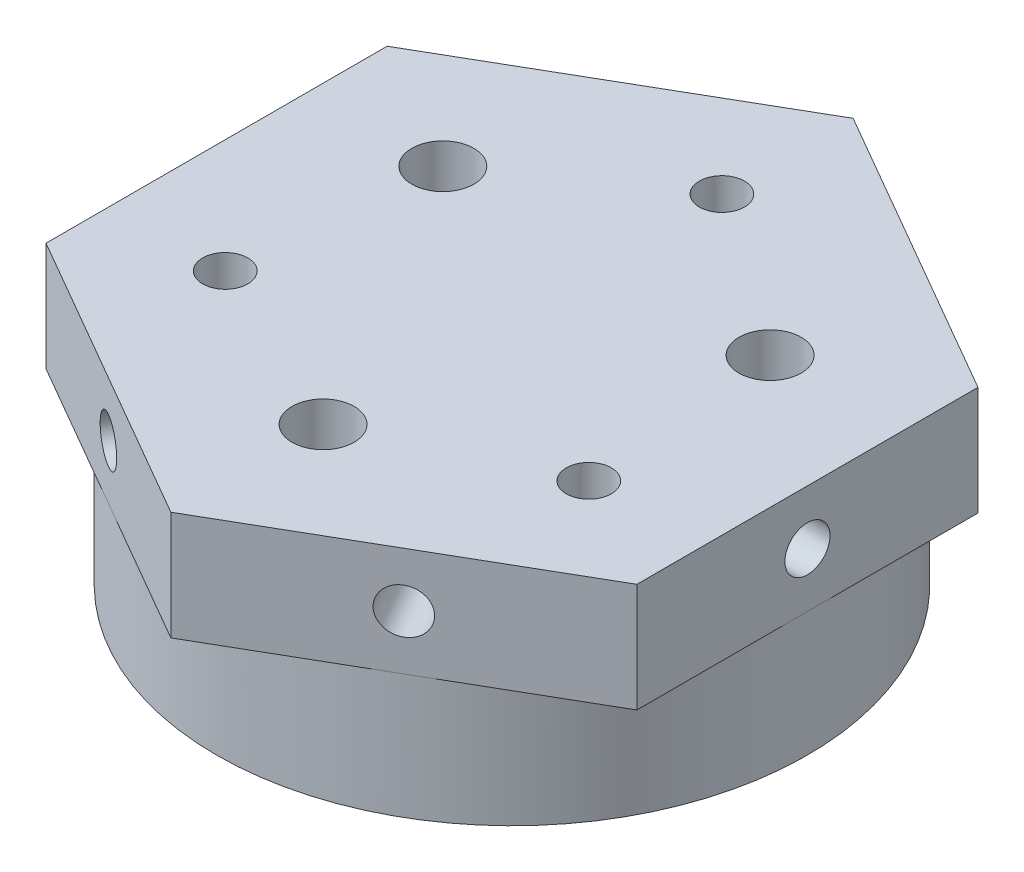
ISO-10303-21;
HEADER;
FILE_DESCRIPTION(('STEP AP214'),'2;1');
FILE_NAME('part.step','',(''),(''),'','','');
FILE_SCHEMA(('AUTOMOTIVE_DESIGN { 1 0 10303 214 1 1 1 1 }'));
ENDSEC;
DATA;
#1=APPLICATION_CONTEXT('core data for automotive mechanical design processes');
#2=APPLICATION_PROTOCOL_DEFINITION('international standard','automotive_design',2000,#1);
#3=PRODUCT_CONTEXT('',#1,'mechanical');
#4=PRODUCT('Part','Part','',(#3));
#5=PRODUCT_RELATED_PRODUCT_CATEGORY('part','',(#4));
#6=PRODUCT_DEFINITION_FORMATION('','',#4);
#7=PRODUCT_DEFINITION_CONTEXT('part definition',#1,'design');
#8=PRODUCT_DEFINITION('design','',#6,#7);
#9=PRODUCT_DEFINITION_SHAPE('','',#8);
#10=(LENGTH_UNIT() NAMED_UNIT(*) SI_UNIT(.MILLI.,.METRE.));
#11=(NAMED_UNIT(*) PLANE_ANGLE_UNIT() SI_UNIT($,.RADIAN.));
#12=(NAMED_UNIT(*) SI_UNIT($,.STERADIAN.) SOLID_ANGLE_UNIT());
#13=UNCERTAINTY_MEASURE_WITH_UNIT(LENGTH_MEASURE(1.E-05),#10,'distance_accuracy_value','');
#14=(GEOMETRIC_REPRESENTATION_CONTEXT(3) GLOBAL_UNCERTAINTY_ASSIGNED_CONTEXT((#13)) GLOBAL_UNIT_ASSIGNED_CONTEXT((#10,
#11,#12)) REPRESENTATION_CONTEXT('',''));
#15=CARTESIAN_POINT('',(0.,0.,0.));
#16=DIRECTION('',(0.,0.,1.));
#17=DIRECTION('',(1.,0.,0.));
#18=AXIS2_PLACEMENT_3D('',#15,#16,#17);
#19=CARTESIAN_POINT('',(0.,15.,0.));
#20=DIRECTION('',(0.,-1.,0.));
#21=DIRECTION('',(0.,0.,-1.));
#22=AXIS2_PLACEMENT_3D('',#19,#20,#21);
#23=CYLINDRICAL_SURFACE('',#22,19.);
#24=CARTESIAN_POINT('',(0.,0.,0.));
#25=DIRECTION('',(0.,1.,0.));
#26=DIRECTION('',(0.,0.,1.));
#27=AXIS2_PLACEMENT_3D('',#24,#25,#26);
#28=CIRCLE('',#27,19.);
#29=CARTESIAN_POINT('',(0.,0.,19.));
#30=VERTEX_POINT('',#29);
#31=EDGE_CURVE('E11',#30,#30,#28,.T.);
#32=ORIENTED_EDGE('',*,*,#31,.T.);
#33=EDGE_LOOP('',(#32));
#34=FACE_BOUND('',#33,.T.);
#35=CARTESIAN_POINT('',(0.,8.,0.));
#36=DIRECTION('',(0.,1.,0.));
#37=DIRECTION('',(0.,0.,1.));
#38=AXIS2_PLACEMENT_3D('',#35,#36,#37);
#39=CIRCLE('',#38,19.);
#40=CARTESIAN_POINT('',(9.50000000000001,8.,16.4544826719043));
#41=VERTEX_POINT('',#40);
#42=CARTESIAN_POINT('',(19.,8.,0.));
#43=VERTEX_POINT('',#42);
#44=EDGE_CURVE('E203',#41,#43,#39,.T.);
#45=ORIENTED_EDGE('',*,*,#44,.F.);
#46=CARTESIAN_POINT('',(-9.50000000000001,8.,16.4544826719043));
#47=VERTEX_POINT('',#46);
#48=EDGE_CURVE('E184',#47,#41,#39,.T.);
#49=ORIENTED_EDGE('',*,*,#48,.F.);
#50=CARTESIAN_POINT('',(-19.,8.,0.));
#51=VERTEX_POINT('',#50);
#52=EDGE_CURVE('E202',#51,#47,#39,.T.);
#53=ORIENTED_EDGE('',*,*,#52,.F.);
#54=CARTESIAN_POINT('',(-9.5,8.,-16.4544826719043));
#55=VERTEX_POINT('',#54);
#56=EDGE_CURVE('E302',#55,#51,#39,.T.);
#57=ORIENTED_EDGE('',*,*,#56,.F.);
#58=CARTESIAN_POINT('',(9.5,8.,-16.4544826719043));
#59=VERTEX_POINT('',#58);
#60=EDGE_CURVE('E61',#59,#55,#39,.T.);
#61=ORIENTED_EDGE('',*,*,#60,.F.);
#62=EDGE_CURVE('E56',#43,#59,#39,.T.);
#63=ORIENTED_EDGE('',*,*,#62,.F.);
#64=EDGE_LOOP('',(#45,#49,#53,#57,#61,#63));
#65=FACE_BOUND('',#64,.T.);
#66=ADVANCED_FACE('F41',(#34,#65),#23,.T.);
#67=CARTESIAN_POINT('',(0.,15.,0.));
#68=DIRECTION('',(0.,1.,0.));
#69=DIRECTION('',(0.,0.,1.));
#70=AXIS2_PLACEMENT_3D('',#67,#68,#69);
#71=PLANE('',#70);
#72=CARTESIAN_POINT('',(0.,15.,12.15));
#73=DIRECTION('',(0.,1.,0.));
#74=DIRECTION('',(0.,0.,1.));
#75=AXIS2_PLACEMENT_3D('',#72,#73,#74);
#76=CIRCLE('',#75,2.);
#77=CARTESIAN_POINT('',(0.,15.,14.15));
#78=VERTEX_POINT('',#77);
#79=EDGE_CURVE('E213',#78,#78,#76,.T.);
#80=ORIENTED_EDGE('',*,*,#79,.F.);
#81=EDGE_LOOP('',(#80));
#82=FACE_BOUND('',#81,.T.);
#83=CARTESIAN_POINT('',(11.6913429510899,15.,6.75000000000006));
#84=DIRECTION('',(0.,1.,0.));
#85=DIRECTION('',(0.,0.,1.));
#86=AXIS2_PLACEMENT_3D('',#83,#84,#85);
#87=CIRCLE('',#86,1.45);
#88=CARTESIAN_POINT('',(11.6913429510899,15.,8.20000000000005));
#89=VERTEX_POINT('',#88);
#90=EDGE_CURVE('E229',#89,#89,#87,.T.);
#91=ORIENTED_EDGE('',*,*,#90,.F.);
#92=EDGE_LOOP('',(#91));
#93=FACE_BOUND('',#92,.T.);
#94=CARTESIAN_POINT('',(0.,15.,-13.5));
#95=DIRECTION('',(0.,1.,0.));
#96=DIRECTION('',(0.,0.,1.));
#97=AXIS2_PLACEMENT_3D('',#94,#95,#96);
#98=CIRCLE('',#97,1.45);
#99=CARTESIAN_POINT('',(0.,15.,-12.05));
#100=VERTEX_POINT('',#99);
#101=EDGE_CURVE('E49',#100,#100,#98,.T.);
#102=ORIENTED_EDGE('',*,*,#101,.F.);
#103=EDGE_LOOP('',(#102));
#104=FACE_BOUND('',#103,.T.);
#105=DIRECTION('',(0.866025403784438,0.,0.5));
#106=VECTOR('',#105,1.);
#107=CARTESIAN_POINT('',(-19.,15.,10.9696551146029));
#108=LINE('',#107,#106);
#109=CARTESIAN_POINT('',(-19.,15.,10.9696551146029));
#110=VERTEX_POINT('',#109);
#111=CARTESIAN_POINT('',(0.,15.,21.9393102292058));
#112=VERTEX_POINT('',#111);
#113=EDGE_CURVE('E172',#110,#112,#108,.T.);
#114=ORIENTED_EDGE('',*,*,#113,.T.);
#115=DIRECTION('',(0.866025403784438,0.,-0.5));
#116=VECTOR('',#115,1.);
#117=CARTESIAN_POINT('',(0.,15.,21.9393102292058));
#118=LINE('',#117,#116);
#119=CARTESIAN_POINT('',(19.,15.,10.9696551146029));
#120=VERTEX_POINT('',#119);
#121=EDGE_CURVE('E175',#112,#120,#118,.T.);
#122=ORIENTED_EDGE('',*,*,#121,.T.);
#123=DIRECTION('',(0.,0.,-1.));
#124=VECTOR('',#123,1.);
#125=CARTESIAN_POINT('',(19.,15.,10.9696551146029));
#126=LINE('',#125,#124);
#127=CARTESIAN_POINT('',(19.,15.,-10.9696551146029));
#128=VERTEX_POINT('',#127);
#129=EDGE_CURVE('E123',#120,#128,#126,.T.);
#130=ORIENTED_EDGE('',*,*,#129,.T.);
#131=DIRECTION('',(-0.866025403784439,0.,-0.5));
#132=VECTOR('',#131,1.);
#133=CARTESIAN_POINT('',(19.,15.,-10.9696551146029));
#134=LINE('',#133,#132);
#135=CARTESIAN_POINT('',(0.,15.,-21.9393102292058));
#136=VERTEX_POINT('',#135);
#137=EDGE_CURVE('E163',#128,#136,#134,.T.);
#138=ORIENTED_EDGE('',*,*,#137,.T.);
#139=DIRECTION('',(-0.866025403784439,0.,0.5));
#140=VECTOR('',#139,1.);
#141=CARTESIAN_POINT('',(0.,15.,-21.9393102292058));
#142=LINE('',#141,#140);
#143=CARTESIAN_POINT('',(-19.,15.,-10.9696551146029));
#144=VERTEX_POINT('',#143);
#145=EDGE_CURVE('E130',#136,#144,#142,.T.);
#146=ORIENTED_EDGE('',*,*,#145,.T.);
#147=DIRECTION('',(0.,0.,1.));
#148=VECTOR('',#147,1.);
#149=CARTESIAN_POINT('',(-19.,15.,-10.9696551146029));
#150=LINE('',#149,#148);
#151=EDGE_CURVE('E169',#144,#110,#150,.T.);
#152=ORIENTED_EDGE('',*,*,#151,.T.);
#153=EDGE_LOOP('',(#114,#122,#130,#138,#146,#152));
#154=FACE_BOUND('',#153,.T.);
#155=CARTESIAN_POINT('',(-11.6913429510899,15.,6.74999999999997));
#156=DIRECTION('',(0.,1.,0.));
#157=DIRECTION('',(0.,0.,1.));
#158=AXIS2_PLACEMENT_3D('',#155,#156,#157);
#159=CIRCLE('',#158,1.45);
#160=CARTESIAN_POINT('',(-11.6913429510899,15.,8.19999999999997));
#161=VERTEX_POINT('',#160);
#162=EDGE_CURVE('E237',#161,#161,#159,.T.);
#163=ORIENTED_EDGE('',*,*,#162,.F.);
#164=EDGE_LOOP('',(#163));
#165=FACE_BOUND('',#164,.T.);
#166=CARTESIAN_POINT('',(-10.5222086559809,15.,-6.07499999999997));
#167=DIRECTION('',(0.,1.,0.));
#168=DIRECTION('',(0.,0.,1.));
#169=AXIS2_PLACEMENT_3D('',#166,#167,#168);
#170=CIRCLE('',#169,2.);
#171=CARTESIAN_POINT('',(-10.5222086559809,15.,-4.07499999999997));
#172=VERTEX_POINT('',#171);
#173=EDGE_CURVE('E221',#172,#172,#170,.T.);
#174=ORIENTED_EDGE('',*,*,#173,.F.);
#175=EDGE_LOOP('',(#174));
#176=FACE_BOUND('',#175,.T.);
#177=CARTESIAN_POINT('',(10.5222086559809,15.,-6.07500000000005));
#178=DIRECTION('',(0.,1.,0.));
#179=DIRECTION('',(0.,0.,1.));
#180=AXIS2_PLACEMENT_3D('',#177,#178,#179);
#181=CIRCLE('',#180,2.);
#182=CARTESIAN_POINT('',(10.5222086559809,15.,-4.07500000000005));
#183=VERTEX_POINT('',#182);
#184=EDGE_CURVE('E204',#183,#183,#181,.T.);
#185=ORIENTED_EDGE('',*,*,#184,.F.);
#186=EDGE_LOOP('',(#185));
#187=FACE_BOUND('',#186,.T.);
#188=ADVANCED_FACE('F266',(#82,#93,#104,#154,#165,#176,#187),#71,.T.);
#189=CARTESIAN_POINT('',(0.,0.,0.));
#190=DIRECTION('',(0.,1.,0.));
#191=DIRECTION('',(0.,0.,1.));
#192=AXIS2_PLACEMENT_3D('',#189,#190,#191);
#193=PLANE('',#192);
#194=ORIENTED_EDGE('',*,*,#31,.F.);
#195=EDGE_LOOP('',(#194));
#196=FACE_BOUND('',#195,.T.);
#197=CARTESIAN_POINT('',(0.,0.,-13.5));
#198=DIRECTION('',(0.,1.,0.));
#199=DIRECTION('',(0.,0.,1.));
#200=AXIS2_PLACEMENT_3D('',#197,#198,#199);
#201=CIRCLE('',#200,1.45);
#202=CARTESIAN_POINT('',(0.,0.,-12.05));
#203=VERTEX_POINT('',#202);
#204=EDGE_CURVE('E241',#203,#203,#201,.T.);
#205=ORIENTED_EDGE('',*,*,#204,.T.);
#206=EDGE_LOOP('',(#205));
#207=FACE_BOUND('',#206,.T.);
#208=CARTESIAN_POINT('',(-11.6913429510899,0.,6.74999999999997));
#209=DIRECTION('',(0.,1.,0.));
#210=DIRECTION('',(0.,0.,1.));
#211=AXIS2_PLACEMENT_3D('',#208,#209,#210);
#212=CIRCLE('',#211,1.45);
#213=CARTESIAN_POINT('',(-11.6913429510899,0.,8.19999999999997));
#214=VERTEX_POINT('',#213);
#215=EDGE_CURVE('E233',#214,#214,#212,.T.);
#216=ORIENTED_EDGE('',*,*,#215,.T.);
#217=EDGE_LOOP('',(#216));
#218=FACE_BOUND('',#217,.T.);
#219=CARTESIAN_POINT('',(11.6913429510899,0.,6.75000000000006));
#220=DIRECTION('',(0.,1.,0.));
#221=DIRECTION('',(0.,0.,1.));
#222=AXIS2_PLACEMENT_3D('',#219,#220,#221);
#223=CIRCLE('',#222,1.45);
#224=CARTESIAN_POINT('',(11.6913429510899,0.,8.20000000000005));
#225=VERTEX_POINT('',#224);
#226=EDGE_CURVE('E225',#225,#225,#223,.T.);
#227=ORIENTED_EDGE('',*,*,#226,.T.);
#228=EDGE_LOOP('',(#227));
#229=FACE_BOUND('',#228,.T.);
#230=CARTESIAN_POINT('',(-10.5222086559809,0.,-6.07499999999997));
#231=DIRECTION('',(0.,1.,0.));
#232=DIRECTION('',(0.,0.,1.));
#233=AXIS2_PLACEMENT_3D('',#230,#231,#232);
#234=CIRCLE('',#233,2.);
#235=CARTESIAN_POINT('',(-10.5222086559809,0.,-4.07499999999997));
#236=VERTEX_POINT('',#235);
#237=EDGE_CURVE('E217',#236,#236,#234,.T.);
#238=ORIENTED_EDGE('',*,*,#237,.T.);
#239=EDGE_LOOP('',(#238));
#240=FACE_BOUND('',#239,.T.);
#241=CARTESIAN_POINT('',(0.,0.,12.15));
#242=DIRECTION('',(0.,1.,0.));
#243=DIRECTION('',(0.,0.,1.));
#244=AXIS2_PLACEMENT_3D('',#241,#242,#243);
#245=CIRCLE('',#244,2.);
#246=CARTESIAN_POINT('',(0.,0.,14.15));
#247=VERTEX_POINT('',#246);
#248=EDGE_CURVE('E208',#247,#247,#245,.T.);
#249=ORIENTED_EDGE('',*,*,#248,.T.);
#250=EDGE_LOOP('',(#249));
#251=FACE_BOUND('',#250,.T.);
#252=CARTESIAN_POINT('',(10.5222086559809,0.,-6.07500000000005));
#253=DIRECTION('',(0.,1.,0.));
#254=DIRECTION('',(0.,0.,1.));
#255=AXIS2_PLACEMENT_3D('',#252,#253,#254);
#256=CIRCLE('',#255,2.);
#257=CARTESIAN_POINT('',(10.5222086559809,0.,-4.07500000000005));
#258=VERTEX_POINT('',#257);
#259=EDGE_CURVE('E209',#258,#258,#256,.T.);
#260=ORIENTED_EDGE('',*,*,#259,.T.);
#261=EDGE_LOOP('',(#260));
#262=FACE_BOUND('',#261,.T.);
#263=ADVANCED_FACE('F251',(#196,#207,#218,#229,#240,#251,#262),#193,.F.);
#264=CARTESIAN_POINT('',(0.,15.,-13.5));
#265=DIRECTION('',(0.,-1.,0.));
#266=DIRECTION('',(0.,0.,-1.));
#267=AXIS2_PLACEMENT_3D('',#264,#265,#266);
#268=CYLINDRICAL_SURFACE('',#267,1.45);
#269=ORIENTED_EDGE('',*,*,#101,.T.);
#270=EDGE_LOOP('',(#269));
#271=FACE_BOUND('',#270,.T.);
#272=ORIENTED_EDGE('',*,*,#204,.F.);
#273=EDGE_LOOP('',(#272));
#274=FACE_BOUND('',#273,.T.);
#275=ADVANCED_FACE('F254',(#271,#274),#268,.F.);
#276=CARTESIAN_POINT('',(-11.6913429510899,15.,6.74999999999997));
#277=DIRECTION('',(0.,-1.,0.));
#278=DIRECTION('',(0.,0.,-1.));
#279=AXIS2_PLACEMENT_3D('',#276,#277,#278);
#280=CYLINDRICAL_SURFACE('',#279,1.45);
#281=ORIENTED_EDGE('',*,*,#162,.T.);
#282=EDGE_LOOP('',(#281));
#283=FACE_BOUND('',#282,.T.);
#284=ORIENTED_EDGE('',*,*,#215,.F.);
#285=EDGE_LOOP('',(#284));
#286=FACE_BOUND('',#285,.T.);
#287=ADVANCED_FACE('F256',(#283,#286),#280,.F.);
#288=CARTESIAN_POINT('',(11.6913429510899,15.,6.75000000000006));
#289=DIRECTION('',(0.,-1.,0.));
#290=DIRECTION('',(0.,0.,-1.));
#291=AXIS2_PLACEMENT_3D('',#288,#289,#290);
#292=CYLINDRICAL_SURFACE('',#291,1.45);
#293=ORIENTED_EDGE('',*,*,#90,.T.);
#294=EDGE_LOOP('',(#293));
#295=FACE_BOUND('',#294,.T.);
#296=ORIENTED_EDGE('',*,*,#226,.F.);
#297=EDGE_LOOP('',(#296));
#298=FACE_BOUND('',#297,.T.);
#299=ADVANCED_FACE('F263',(#295,#298),#292,.F.);
#300=CARTESIAN_POINT('',(-10.5222086559809,15.,-6.07499999999997));
#301=DIRECTION('',(0.,-1.,0.));
#302=DIRECTION('',(0.,0.,-1.));
#303=AXIS2_PLACEMENT_3D('',#300,#301,#302);
#304=CYLINDRICAL_SURFACE('',#303,2.);
#305=ORIENTED_EDGE('',*,*,#173,.T.);
#306=EDGE_LOOP('',(#305));
#307=FACE_BOUND('',#306,.T.);
#308=ORIENTED_EDGE('',*,*,#237,.F.);
#309=EDGE_LOOP('',(#308));
#310=FACE_BOUND('',#309,.T.);
#311=ADVANCED_FACE('F358',(#307,#310),#304,.F.);
#312=CARTESIAN_POINT('',(0.,15.,12.15));
#313=DIRECTION('',(0.,-1.,0.));
#314=DIRECTION('',(0.,0.,-1.));
#315=AXIS2_PLACEMENT_3D('',#312,#313,#314);
#316=CYLINDRICAL_SURFACE('',#315,2.);
#317=ORIENTED_EDGE('',*,*,#79,.T.);
#318=EDGE_LOOP('',(#317));
#319=FACE_BOUND('',#318,.T.);
#320=ORIENTED_EDGE('',*,*,#248,.F.);
#321=EDGE_LOOP('',(#320));
#322=FACE_BOUND('',#321,.T.);
#323=ADVANCED_FACE('F354',(#319,#322),#316,.F.);
#324=CARTESIAN_POINT('',(10.5222086559809,15.,-6.07500000000005));
#325=DIRECTION('',(0.,-1.,0.));
#326=DIRECTION('',(0.,0.,-1.));
#327=AXIS2_PLACEMENT_3D('',#324,#325,#326);
#328=CYLINDRICAL_SURFACE('',#327,2.);
#329=ORIENTED_EDGE('',*,*,#184,.T.);
#330=EDGE_LOOP('',(#329));
#331=FACE_BOUND('',#330,.T.);
#332=ORIENTED_EDGE('',*,*,#259,.F.);
#333=EDGE_LOOP('',(#332));
#334=FACE_BOUND('',#333,.T.);
#335=ADVANCED_FACE('F350',(#331,#334),#328,.F.);
#336=CARTESIAN_POINT('',(19.,8.,-10.9696551146029));
#337=DIRECTION('',(0.5,0.,-0.866025403784439));
#338=DIRECTION('',(-0.866025403784439,0.,-0.5));
#339=AXIS2_PLACEMENT_3D('',#336,#337,#338);
#340=PLANE('',#339);
#341=CARTESIAN_POINT('',(9.5,11.5,-16.4544826719043));
#342=DIRECTION('',(0.5,0.,-0.866025403784439));
#343=DIRECTION('',(-0.866025403784439,0.,-0.5));
#344=AXIS2_PLACEMENT_3D('',#341,#342,#343);
#345=CIRCLE('',#344,1.45);
#346=CARTESIAN_POINT('',(8.24426316451257,11.5,-17.1794826719043));
#347=VERTEX_POINT('',#346);
#348=EDGE_CURVE('E553',#347,#347,#345,.T.);
#349=ORIENTED_EDGE('',*,*,#348,.F.);
#350=EDGE_LOOP('',(#349));
#351=FACE_BOUND('',#350,.T.);
#352=DIRECTION('',(-0.866025403784439,0.,-0.5));
#353=VECTOR('',#352,1.);
#354=CARTESIAN_POINT('',(19.,8.,-10.9696551146029));
#355=LINE('',#354,#353);
#356=CARTESIAN_POINT('',(19.,8.,-10.9696551146029));
#357=VERTEX_POINT('',#356);
#358=EDGE_CURVE('E119',#357,#59,#355,.T.);
#359=ORIENTED_EDGE('',*,*,#358,.T.);
#360=CARTESIAN_POINT('',(0.,8.,-21.9393102292058));
#361=VERTEX_POINT('',#360);
#362=EDGE_CURVE('E111',#59,#361,#355,.T.);
#363=ORIENTED_EDGE('',*,*,#362,.T.);
#364=DIRECTION('',(0.,1.,0.));
#365=VECTOR('',#364,1.);
#366=CARTESIAN_POINT('',(0.,8.,-21.9393102292058));
#367=LINE('',#366,#365);
#368=EDGE_CURVE('E115',#361,#136,#367,.T.);
#369=ORIENTED_EDGE('',*,*,#368,.T.);
#370=ORIENTED_EDGE('',*,*,#137,.F.);
#371=DIRECTION('',(0.,1.,0.));
#372=VECTOR('',#371,1.);
#373=CARTESIAN_POINT('',(19.,8.,-10.9696551146029));
#374=LINE('',#373,#372);
#375=EDGE_CURVE('E180',#357,#128,#374,.T.);
#376=ORIENTED_EDGE('',*,*,#375,.F.);
#377=EDGE_LOOP('',(#359,#363,#369,#370,#376));
#378=FACE_BOUND('',#377,.T.);
#379=ADVANCED_FACE('F113',(#351,#378),#340,.T.);
#380=CARTESIAN_POINT('',(19.,8.,10.9696551146029));
#381=DIRECTION('',(1.,0.,0.));
#382=DIRECTION('',(0.,0.,-1.));
#383=AXIS2_PLACEMENT_3D('',#380,#381,#382);
#384=PLANE('',#383);
#385=CARTESIAN_POINT('',(19.,11.5,0.));
#386=DIRECTION('',(1.,0.,0.));
#387=DIRECTION('',(0.,0.,-1.));
#388=AXIS2_PLACEMENT_3D('',#385,#386,#387);
#389=CIRCLE('',#388,1.45);
#390=CARTESIAN_POINT('',(19.,11.5,-1.45000000000001));
#391=VERTEX_POINT('',#390);
#392=EDGE_CURVE('E552',#391,#391,#389,.T.);
#393=ORIENTED_EDGE('',*,*,#392,.F.);
#394=EDGE_LOOP('',(#393));
#395=FACE_BOUND('',#394,.T.);
#396=DIRECTION('',(0.,0.,-1.));
#397=VECTOR('',#396,1.);
#398=CARTESIAN_POINT('',(19.,8.,10.9696551146029));
#399=LINE('',#398,#397);
#400=CARTESIAN_POINT('',(19.,8.,10.9696551146029));
#401=VERTEX_POINT('',#400);
#402=EDGE_CURVE('E133',#401,#43,#399,.T.);
#403=ORIENTED_EDGE('',*,*,#402,.T.);
#404=EDGE_CURVE('E159',#43,#357,#399,.T.);
#405=ORIENTED_EDGE('',*,*,#404,.T.);
#406=ORIENTED_EDGE('',*,*,#375,.T.);
#407=ORIENTED_EDGE('',*,*,#129,.F.);
#408=DIRECTION('',(0.,1.,0.));
#409=VECTOR('',#408,1.);
#410=CARTESIAN_POINT('',(19.,8.,10.9696551146029));
#411=LINE('',#410,#409);
#412=EDGE_CURVE('E185',#401,#120,#411,.T.);
#413=ORIENTED_EDGE('',*,*,#412,.F.);
#414=EDGE_LOOP('',(#403,#405,#406,#407,#413));
#415=FACE_BOUND('',#414,.T.);
#416=ADVANCED_FACE('F309',(#395,#415),#384,.T.);
#417=CARTESIAN_POINT('',(0.,8.,21.9393102292058));
#418=DIRECTION('',(0.5,0.,0.866025403784438));
#419=DIRECTION('',(0.866025403784438,0.,-0.5));
#420=AXIS2_PLACEMENT_3D('',#417,#418,#419);
#421=PLANE('',#420);
#422=CARTESIAN_POINT('',(9.50000000000001,11.5,16.4544826719043));
#423=DIRECTION('',(0.5,0.,0.866025403784438));
#424=DIRECTION('',(0.866025403784438,0.,-0.5));
#425=AXIS2_PLACEMENT_3D('',#422,#423,#424);
#426=CIRCLE('',#425,1.45);
#427=CARTESIAN_POINT('',(10.7557368354874,11.5,15.7294826719043));
#428=VERTEX_POINT('',#427);
#429=EDGE_CURVE('E579',#428,#428,#426,.T.);
#430=ORIENTED_EDGE('',*,*,#429,.F.);
#431=EDGE_LOOP('',(#430));
#432=FACE_BOUND('',#431,.T.);
#433=DIRECTION('',(0.866025403784438,0.,-0.5));
#434=VECTOR('',#433,1.);
#435=CARTESIAN_POINT('',(0.,8.,21.9393102292058));
#436=LINE('',#435,#434);
#437=CARTESIAN_POINT('',(0.,8.,21.9393102292058));
#438=VERTEX_POINT('',#437);
#439=EDGE_CURVE('E155',#438,#41,#436,.T.);
#440=ORIENTED_EDGE('',*,*,#439,.T.);
#441=EDGE_CURVE('E154',#41,#401,#436,.T.);
#442=ORIENTED_EDGE('',*,*,#441,.T.);
#443=ORIENTED_EDGE('',*,*,#412,.T.);
#444=ORIENTED_EDGE('',*,*,#121,.F.);
#445=DIRECTION('',(0.,1.,0.));
#446=VECTOR('',#445,1.);
#447=CARTESIAN_POINT('',(0.,8.,21.9393102292058));
#448=LINE('',#447,#446);
#449=EDGE_CURVE('E189',#438,#112,#448,.T.);
#450=ORIENTED_EDGE('',*,*,#449,.F.);
#451=EDGE_LOOP('',(#440,#442,#443,#444,#450));
#452=FACE_BOUND('',#451,.T.);
#453=ADVANCED_FACE('F291',(#432,#452),#421,.T.);
#454=CARTESIAN_POINT('',(-19.,8.,10.9696551146029));
#455=DIRECTION('',(-0.5,0.,0.866025403784438));
#456=DIRECTION('',(0.866025403784438,0.,0.5));
#457=AXIS2_PLACEMENT_3D('',#454,#455,#456);
#458=PLANE('',#457);
#459=CARTESIAN_POINT('',(-9.50000000000001,11.5,16.4544826719043));
#460=DIRECTION('',(-0.5,0.,0.866025403784438));
#461=DIRECTION('',(0.866025403784439,0.,0.5));
#462=AXIS2_PLACEMENT_3D('',#459,#460,#461);
#463=CIRCLE('',#462,1.45);
#464=CARTESIAN_POINT('',(-8.24426316451258,11.5,17.1794826719043));
#465=VERTEX_POINT('',#464);
#466=EDGE_CURVE('E571',#465,#465,#463,.T.);
#467=ORIENTED_EDGE('',*,*,#466,.F.);
#468=EDGE_LOOP('',(#467));
#469=FACE_BOUND('',#468,.T.);
#470=DIRECTION('',(0.866025403784438,0.,0.5));
#471=VECTOR('',#470,1.);
#472=CARTESIAN_POINT('',(-19.,8.,10.9696551146029));
#473=LINE('',#472,#471);
#474=CARTESIAN_POINT('',(-19.,8.,10.9696551146029));
#475=VERTEX_POINT('',#474);
#476=EDGE_CURVE('E150',#475,#47,#473,.T.);
#477=ORIENTED_EDGE('',*,*,#476,.T.);
#478=EDGE_CURVE('E149',#47,#438,#473,.T.);
#479=ORIENTED_EDGE('',*,*,#478,.T.);
#480=ORIENTED_EDGE('',*,*,#449,.T.);
#481=ORIENTED_EDGE('',*,*,#113,.F.);
#482=DIRECTION('',(0.,1.,0.));
#483=VECTOR('',#482,1.);
#484=CARTESIAN_POINT('',(-19.,8.,10.9696551146029));
#485=LINE('',#484,#483);
#486=EDGE_CURVE('E193',#475,#110,#485,.T.);
#487=ORIENTED_EDGE('',*,*,#486,.F.);
#488=EDGE_LOOP('',(#477,#479,#480,#481,#487));
#489=FACE_BOUND('',#488,.T.);
#490=ADVANCED_FACE('F295',(#469,#489),#458,.T.);
#491=CARTESIAN_POINT('',(-19.,8.,-10.9696551146029));
#492=DIRECTION('',(-1.,0.,0.));
#493=DIRECTION('',(0.,0.,1.));
#494=AXIS2_PLACEMENT_3D('',#491,#492,#493);
#495=PLANE('',#494);
#496=CARTESIAN_POINT('',(-19.,11.5,0.));
#497=DIRECTION('',(-1.,0.,0.));
#498=DIRECTION('',(0.,0.,1.));
#499=AXIS2_PLACEMENT_3D('',#496,#497,#498);
#500=CIRCLE('',#499,1.45);
#501=CARTESIAN_POINT('',(-19.,11.5,1.45000000000001));
#502=VERTEX_POINT('',#501);
#503=EDGE_CURVE('E565',#502,#502,#500,.T.);
#504=ORIENTED_EDGE('',*,*,#503,.F.);
#505=EDGE_LOOP('',(#504));
#506=FACE_BOUND('',#505,.T.);
#507=DIRECTION('',(0.,0.,1.));
#508=VECTOR('',#507,1.);
#509=CARTESIAN_POINT('',(-19.,8.,-10.9696551146029));
#510=LINE('',#509,#508);
#511=CARTESIAN_POINT('',(-19.,8.,-10.9696551146029));
#512=VERTEX_POINT('',#511);
#513=EDGE_CURVE('E143',#512,#51,#510,.T.);
#514=ORIENTED_EDGE('',*,*,#513,.T.);
#515=EDGE_CURVE('E138',#51,#475,#510,.T.);
#516=ORIENTED_EDGE('',*,*,#515,.T.);
#517=ORIENTED_EDGE('',*,*,#486,.T.);
#518=ORIENTED_EDGE('',*,*,#151,.F.);
#519=DIRECTION('',(0.,1.,0.));
#520=VECTOR('',#519,1.);
#521=CARTESIAN_POINT('',(-19.,8.,-10.9696551146029));
#522=LINE('',#521,#520);
#523=EDGE_CURVE('E132',#512,#144,#522,.T.);
#524=ORIENTED_EDGE('',*,*,#523,.F.);
#525=EDGE_LOOP('',(#514,#516,#517,#518,#524));
#526=FACE_BOUND('',#525,.T.);
#527=ADVANCED_FACE('F316',(#506,#526),#495,.T.);
#528=CARTESIAN_POINT('',(0.,8.,-21.9393102292058));
#529=DIRECTION('',(-0.5,0.,-0.866025403784439));
#530=DIRECTION('',(-0.866025403784439,0.,0.5));
#531=AXIS2_PLACEMENT_3D('',#528,#529,#530);
#532=PLANE('',#531);
#533=DIRECTION('',(-0.866025403784439,0.,0.5));
#534=VECTOR('',#533,1.);
#535=CARTESIAN_POINT('',(0.,8.,-21.9393102292058));
#536=LINE('',#535,#534);
#537=EDGE_CURVE('E128',#361,#55,#536,.T.);
#538=ORIENTED_EDGE('',*,*,#537,.T.);
#539=EDGE_CURVE('E139',#55,#512,#536,.T.);
#540=ORIENTED_EDGE('',*,*,#539,.T.);
#541=ORIENTED_EDGE('',*,*,#523,.T.);
#542=ORIENTED_EDGE('',*,*,#145,.F.);
#543=ORIENTED_EDGE('',*,*,#368,.F.);
#544=EDGE_LOOP('',(#538,#540,#541,#542,#543));
#545=FACE_BOUND('',#544,.T.);
#546=ADVANCED_FACE('F127',(#545),#532,.T.);
#547=CARTESIAN_POINT('',(0.,8.,0.));
#548=DIRECTION('',(0.,1.,0.));
#549=DIRECTION('',(0.,0.,1.));
#550=AXIS2_PLACEMENT_3D('',#547,#548,#549);
#551=PLANE('',#550);
#552=ORIENTED_EDGE('',*,*,#441,.F.);
#553=ORIENTED_EDGE('',*,*,#44,.T.);
#554=ORIENTED_EDGE('',*,*,#402,.F.);
#555=EDGE_LOOP('',(#552,#553,#554));
#556=FACE_BOUND('',#555,.T.);
#557=ADVANCED_FACE('F286',(#556),#551,.F.);
#558=ORIENTED_EDGE('',*,*,#404,.F.);
#559=ORIENTED_EDGE('',*,*,#62,.T.);
#560=ORIENTED_EDGE('',*,*,#358,.F.);
#561=EDGE_LOOP('',(#558,#559,#560));
#562=FACE_BOUND('',#561,.T.);
#563=ADVANCED_FACE('F307',(#562),#551,.F.);
#564=ORIENTED_EDGE('',*,*,#362,.F.);
#565=ORIENTED_EDGE('',*,*,#60,.T.);
#566=ORIENTED_EDGE('',*,*,#537,.F.);
#567=EDGE_LOOP('',(#564,#565,#566));
#568=FACE_BOUND('',#567,.T.);
#569=ADVANCED_FACE('F135',(#568),#551,.F.);
#570=ORIENTED_EDGE('',*,*,#539,.F.);
#571=ORIENTED_EDGE('',*,*,#56,.T.);
#572=ORIENTED_EDGE('',*,*,#513,.F.);
#573=EDGE_LOOP('',(#570,#571,#572));
#574=FACE_BOUND('',#573,.T.);
#575=ADVANCED_FACE('F322',(#574),#551,.F.);
#576=ORIENTED_EDGE('',*,*,#515,.F.);
#577=ORIENTED_EDGE('',*,*,#52,.T.);
#578=ORIENTED_EDGE('',*,*,#476,.F.);
#579=EDGE_LOOP('',(#576,#577,#578));
#580=FACE_BOUND('',#579,.T.);
#581=ADVANCED_FACE('F319',(#580),#551,.F.);
#582=ORIENTED_EDGE('',*,*,#478,.F.);
#583=ORIENTED_EDGE('',*,*,#48,.T.);
#584=ORIENTED_EDGE('',*,*,#439,.F.);
#585=EDGE_LOOP('',(#582,#583,#584));
#586=FACE_BOUND('',#585,.T.);
#587=ADVANCED_FACE('F285',(#586),#551,.F.);
#588=CARTESIAN_POINT('',(5.50000000000001,11.5,9.52627944162883));
#589=DIRECTION('',(0.5,0.,0.866025403784438));
#590=DIRECTION('',(0.866025403784438,0.,-0.5));
#591=AXIS2_PLACEMENT_3D('',#588,#589,#590);
#592=CYLINDRICAL_SURFACE('',#591,1.45);
#593=CARTESIAN_POINT('',(5.50000000000001,11.5,9.52627944162883));
#594=DIRECTION('',(0.5,0.,0.866025403784438));
#595=DIRECTION('',(0.866025403784438,0.,-0.5));
#596=AXIS2_PLACEMENT_3D('',#593,#594,#595);
#597=CIRCLE('',#596,1.45);
#598=CARTESIAN_POINT('',(6.75573683548745,11.5,8.80127944162883));
#599=VERTEX_POINT('',#598);
#600=EDGE_CURVE('E166',#599,#599,#597,.T.);
#601=ORIENTED_EDGE('',*,*,#600,.F.);
#602=EDGE_LOOP('',(#601));
#603=FACE_BOUND('',#602,.T.);
#604=ORIENTED_EDGE('',*,*,#429,.T.);
#605=EDGE_LOOP('',(#604));
#606=FACE_BOUND('',#605,.T.);
#607=ADVANCED_FACE('F332',(#603,#606),#592,.F.);
#608=CARTESIAN_POINT('',(5.50000000000001,11.5,9.52627944162883));
#609=DIRECTION('',(0.5,0.,0.866025403784438));
#610=DIRECTION('',(0.866025403784438,0.,-0.5));
#611=AXIS2_PLACEMENT_3D('',#608,#609,#610);
#612=PLANE('',#611);
#613=ORIENTED_EDGE('',*,*,#600,.T.);
#614=EDGE_LOOP('',(#613));
#615=FACE_BOUND('',#614,.T.);
#616=ADVANCED_FACE('F464',(#615),#612,.T.);
#617=CARTESIAN_POINT('',(-5.50000000000001,11.5,9.52627944162883));
#618=DIRECTION('',(-0.5,0.,0.866025403784439));
#619=DIRECTION('',(0.866025403784438,0.,0.5));
#620=AXIS2_PLACEMENT_3D('',#617,#618,#619);
#621=CYLINDRICAL_SURFACE('',#620,1.45);
#622=CARTESIAN_POINT('',(-5.50000000000001,11.5,9.52627944162883));
#623=DIRECTION('',(-0.5,0.,0.866025403784438));
#624=DIRECTION('',(0.866025403784439,0.,0.5));
#625=AXIS2_PLACEMENT_3D('',#622,#623,#624);
#626=CIRCLE('',#625,1.45);
#627=CARTESIAN_POINT('',(-4.24426316451257,11.5,10.2512794416288));
#628=VERTEX_POINT('',#627);
#629=EDGE_CURVE('E575',#628,#628,#626,.T.);
#630=ORIENTED_EDGE('',*,*,#629,.F.);
#631=EDGE_LOOP('',(#630));
#632=FACE_BOUND('',#631,.T.);
#633=ORIENTED_EDGE('',*,*,#466,.T.);
#634=EDGE_LOOP('',(#633));
#635=FACE_BOUND('',#634,.T.);
#636=ADVANCED_FACE('F469',(#632,#635),#621,.F.);
#637=CARTESIAN_POINT('',(-5.50000000000001,11.5,9.52627944162883));
#638=DIRECTION('',(-0.5,0.,0.866025403784438));
#639=DIRECTION('',(0.866025403784439,0.,0.5));
#640=AXIS2_PLACEMENT_3D('',#637,#638,#639);
#641=PLANE('',#640);
#642=ORIENTED_EDGE('',*,*,#629,.T.);
#643=EDGE_LOOP('',(#642));
#644=FACE_BOUND('',#643,.T.);
#645=ADVANCED_FACE('F475',(#644),#641,.T.);
#646=CARTESIAN_POINT('',(-11.,11.5,0.));
#647=DIRECTION('',(-1.,0.,0.));
#648=DIRECTION('',(0.,0.,1.));
#649=AXIS2_PLACEMENT_3D('',#646,#647,#648);
#650=CYLINDRICAL_SURFACE('',#649,1.45);
#651=CARTESIAN_POINT('',(-11.,11.5,0.));
#652=DIRECTION('',(-1.,0.,0.));
#653=DIRECTION('',(0.,0.,1.));
#654=AXIS2_PLACEMENT_3D('',#651,#652,#653);
#655=CIRCLE('',#654,1.45);
#656=CARTESIAN_POINT('',(-11.,11.5,1.45));
#657=VERTEX_POINT('',#656);
#658=EDGE_CURVE('E567',#657,#657,#655,.T.);
#659=ORIENTED_EDGE('',*,*,#658,.F.);
#660=EDGE_LOOP('',(#659));
#661=FACE_BOUND('',#660,.T.);
#662=ORIENTED_EDGE('',*,*,#503,.T.);
#663=EDGE_LOOP('',(#662));
#664=FACE_BOUND('',#663,.T.);
#665=ADVANCED_FACE('F482',(#661,#664),#650,.F.);
#666=CARTESIAN_POINT('',(-11.,11.5,0.));
#667=DIRECTION('',(-1.,0.,0.));
#668=DIRECTION('',(0.,0.,1.));
#669=AXIS2_PLACEMENT_3D('',#666,#667,#668);
#670=PLANE('',#669);
#671=ORIENTED_EDGE('',*,*,#658,.T.);
#672=EDGE_LOOP('',(#671));
#673=FACE_BOUND('',#672,.T.);
#674=ADVANCED_FACE('F489',(#673),#670,.T.);
#675=CARTESIAN_POINT('',(11.,11.5,0.));
#676=DIRECTION('',(1.,0.,0.));
#677=DIRECTION('',(0.,0.,-1.));
#678=AXIS2_PLACEMENT_3D('',#675,#676,#677);
#679=CYLINDRICAL_SURFACE('',#678,1.45);
#680=CARTESIAN_POINT('',(11.,11.5,0.));
#681=DIRECTION('',(1.,0.,0.));
#682=DIRECTION('',(0.,0.,-1.));
#683=AXIS2_PLACEMENT_3D('',#680,#681,#682);
#684=CIRCLE('',#683,1.45);
#685=CARTESIAN_POINT('',(11.,11.5,-1.45));
#686=VERTEX_POINT('',#685);
#687=EDGE_CURVE('E558',#686,#686,#684,.T.);
#688=ORIENTED_EDGE('',*,*,#687,.F.);
#689=EDGE_LOOP('',(#688));
#690=FACE_BOUND('',#689,.T.);
#691=ORIENTED_EDGE('',*,*,#392,.T.);
#692=EDGE_LOOP('',(#691));
#693=FACE_BOUND('',#692,.T.);
#694=ADVANCED_FACE('F496',(#690,#693),#679,.F.);
#695=CARTESIAN_POINT('',(11.,11.5,0.));
#696=DIRECTION('',(1.,0.,0.));
#697=DIRECTION('',(0.,0.,-1.));
#698=AXIS2_PLACEMENT_3D('',#695,#696,#697);
#699=PLANE('',#698);
#700=ORIENTED_EDGE('',*,*,#687,.T.);
#701=EDGE_LOOP('',(#700));
#702=FACE_BOUND('',#701,.T.);
#703=ADVANCED_FACE('F503',(#702),#699,.T.);
#704=CARTESIAN_POINT('',(5.5,11.5,-9.52627944162884));
#705=DIRECTION('',(0.5,0.,-0.866025403784439));
#706=DIRECTION('',(-0.866025403784439,0.,-0.5));
#707=AXIS2_PLACEMENT_3D('',#704,#705,#706);
#708=CYLINDRICAL_SURFACE('',#707,1.45);
#709=CARTESIAN_POINT('',(5.5,11.5,-9.52627944162884));
#710=DIRECTION('',(0.5,0.,-0.866025403784439));
#711=DIRECTION('',(-0.866025403784439,0.,-0.5));
#712=AXIS2_PLACEMENT_3D('',#709,#710,#711);
#713=CIRCLE('',#712,1.45);
#714=CARTESIAN_POINT('',(4.24426316451257,11.5,-10.2512794416288));
#715=VERTEX_POINT('',#714);
#716=EDGE_CURVE('E550',#715,#715,#713,.T.);
#717=ORIENTED_EDGE('',*,*,#716,.F.);
#718=EDGE_LOOP('',(#717));
#719=FACE_BOUND('',#718,.T.);
#720=ORIENTED_EDGE('',*,*,#348,.T.);
#721=EDGE_LOOP('',(#720));
#722=FACE_BOUND('',#721,.T.);
#723=ADVANCED_FACE('F510',(#719,#722),#708,.F.);
#724=CARTESIAN_POINT('',(5.5,11.5,-9.52627944162884));
#725=DIRECTION('',(0.5,0.,-0.866025403784439));
#726=DIRECTION('',(-0.866025403784439,0.,-0.5));
#727=AXIS2_PLACEMENT_3D('',#724,#725,#726);
#728=PLANE('',#727);
#729=ORIENTED_EDGE('',*,*,#716,.T.);
#730=EDGE_LOOP('',(#729));
#731=FACE_BOUND('',#730,.T.);
#732=ADVANCED_FACE('F517',(#731),#728,.T.);
#733=CLOSED_SHELL('',(#66,#188,#263,#275,#287,#299,#311,#323,#335,#379,#416,#453,#490,#527,#546,
#557,#563,#569,#575,#581,#587,#607,#616,#636,#645,#665,#674,#694,#703,#723,#732));
#734=MANIFOLD_SOLID_BREP('B2',#733);
#735=ADVANCED_BREP_SHAPE_REPRESENTATION('',(#18,#734),#14);
#736=SHAPE_DEFINITION_REPRESENTATION(#9,#735);
ENDSEC;
END-ISO-10303-21;
